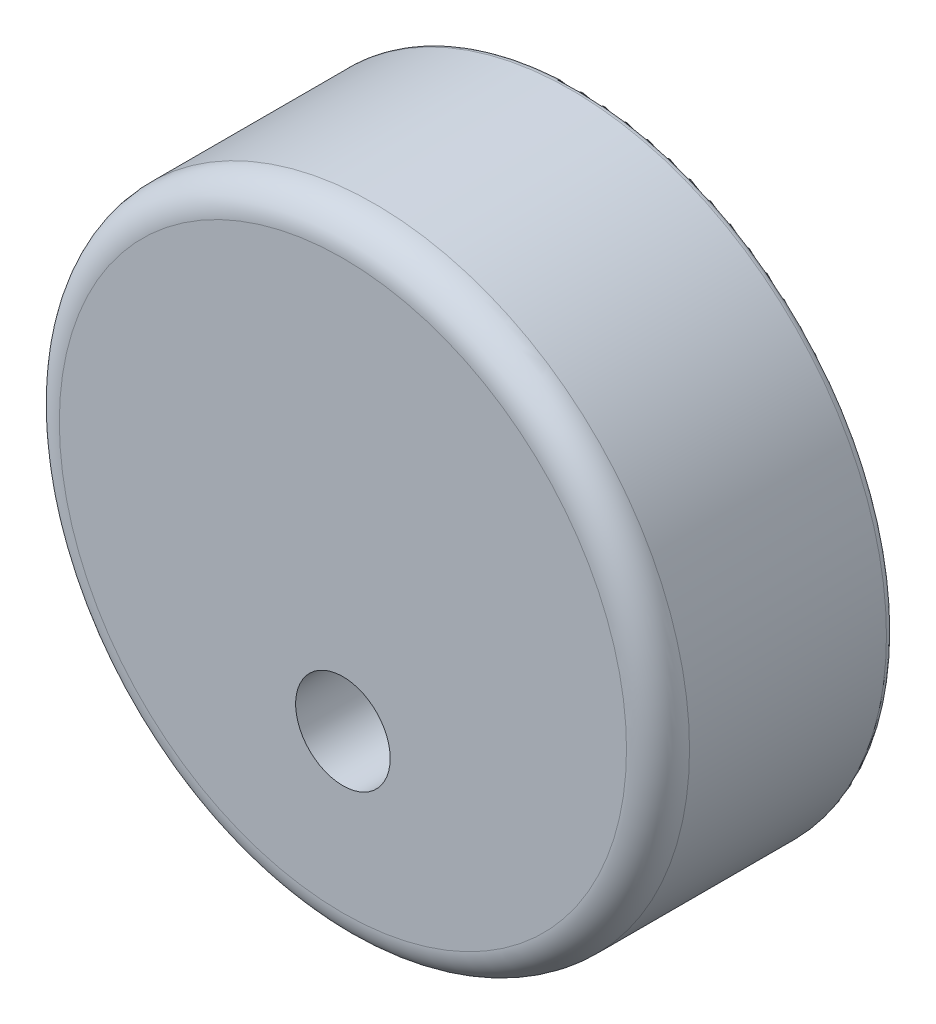
ISO-10303-21;
HEADER;
FILE_DESCRIPTION(('STEP AP214'),'2;1');
FILE_NAME('part.step','',(''),(''),'','','');
FILE_SCHEMA(('AUTOMOTIVE_DESIGN { 1 0 10303 214 1 1 1 1 }'));
ENDSEC;
DATA;
#1=APPLICATION_CONTEXT('core data for automotive mechanical design processes');
#2=APPLICATION_PROTOCOL_DEFINITION('international standard','automotive_design',2000,#1);
#3=PRODUCT_CONTEXT('',#1,'mechanical');
#4=PRODUCT('Part','Part','',(#3));
#5=PRODUCT_RELATED_PRODUCT_CATEGORY('part','',(#4));
#6=PRODUCT_DEFINITION_FORMATION('','',#4);
#7=PRODUCT_DEFINITION_CONTEXT('part definition',#1,'design');
#8=PRODUCT_DEFINITION('design','',#6,#7);
#9=PRODUCT_DEFINITION_SHAPE('','',#8);
#10=(LENGTH_UNIT() NAMED_UNIT(*) SI_UNIT(.MILLI.,.METRE.));
#11=(NAMED_UNIT(*) PLANE_ANGLE_UNIT() SI_UNIT($,.RADIAN.));
#12=(NAMED_UNIT(*) SI_UNIT($,.STERADIAN.) SOLID_ANGLE_UNIT());
#13=UNCERTAINTY_MEASURE_WITH_UNIT(LENGTH_MEASURE(1.E-05),#10,'distance_accuracy_value','');
#14=(GEOMETRIC_REPRESENTATION_CONTEXT(3) GLOBAL_UNCERTAINTY_ASSIGNED_CONTEXT((#13)) GLOBAL_UNIT_ASSIGNED_CONTEXT((#10,
#11,#12)) REPRESENTATION_CONTEXT('',''));
#15=CARTESIAN_POINT('',(0.,0.,0.));
#16=DIRECTION('',(0.,0.,1.));
#17=DIRECTION('',(1.,0.,0.));
#18=AXIS2_PLACEMENT_3D('',#15,#16,#17);
#19=CARTESIAN_POINT('',(0.,0.,15.));
#20=DIRECTION('',(0.,0.,-1.));
#21=DIRECTION('',(-1.,0.,0.));
#22=AXIS2_PLACEMENT_3D('',#19,#20,#21);
#23=CYLINDRICAL_SURFACE('',#22,20.);
#24=CARTESIAN_POINT('',(0.,0.,0.5));
#25=DIRECTION('',(0.,0.,1.));
#26=DIRECTION('',(1.,0.,0.));
#27=AXIS2_PLACEMENT_3D('',#24,#25,#26);
#28=CIRCLE('',#27,20.);
#29=CARTESIAN_POINT('',(20.,0.,0.5));
#30=VERTEX_POINT('',#29);
#31=EDGE_CURVE('E39',#30,#30,#28,.T.);
#32=ORIENTED_EDGE('',*,*,#31,.T.);
#33=EDGE_LOOP('',(#32));
#34=FACE_BOUND('',#33,.T.);
#35=CARTESIAN_POINT('',(0.,0.,13.));
#36=DIRECTION('',(0.,0.,1.));
#37=DIRECTION('',(1.,0.,0.));
#38=AXIS2_PLACEMENT_3D('',#35,#36,#37);
#39=CIRCLE('',#38,20.);
#40=CARTESIAN_POINT('',(20.,0.,13.));
#41=VERTEX_POINT('',#40);
#42=EDGE_CURVE('E43',#41,#41,#39,.F.);
#43=ORIENTED_EDGE('',*,*,#42,.T.);
#44=EDGE_LOOP('',(#43));
#45=FACE_BOUND('',#44,.T.);
#46=ADVANCED_FACE('F32',(#34,#45),#23,.T.);
#47=CARTESIAN_POINT('',(0.,0.,15.));
#48=DIRECTION('',(0.,0.,1.));
#49=DIRECTION('',(1.,0.,0.));
#50=AXIS2_PLACEMENT_3D('',#47,#48,#49);
#51=PLANE('',#50);
#52=CARTESIAN_POINT('',(0.,0.,15.));
#53=DIRECTION('',(0.,0.,1.));
#54=DIRECTION('',(1.,0.,0.));
#55=AXIS2_PLACEMENT_3D('',#52,#53,#54);
#56=CIRCLE('',#55,18.);
#57=CARTESIAN_POINT('',(18.,0.,15.));
#58=VERTEX_POINT('',#57);
#59=EDGE_CURVE('E47',#58,#58,#56,.T.);
#60=ORIENTED_EDGE('',*,*,#59,.T.);
#61=EDGE_LOOP('',(#60));
#62=FACE_BOUND('',#61,.T.);
#63=CARTESIAN_POINT('',(0.,-8.,15.));
#64=DIRECTION('',(0.,0.,1.));
#65=DIRECTION('',(1.,0.,0.));
#66=AXIS2_PLACEMENT_3D('',#63,#64,#65);
#67=CIRCLE('',#66,3.);
#68=CARTESIAN_POINT('',(3.,-8.,15.));
#69=VERTEX_POINT('',#68);
#70=EDGE_CURVE('E53',#69,#69,#67,.T.);
#71=ORIENTED_EDGE('',*,*,#70,.F.);
#72=EDGE_LOOP('',(#71));
#73=FACE_BOUND('',#72,.T.);
#74=ADVANCED_FACE('F68',(#62,#73),#51,.T.);
#75=CARTESIAN_POINT('',(0.,0.,0.));
#76=DIRECTION('',(0.,0.,1.));
#77=DIRECTION('',(1.,0.,0.));
#78=AXIS2_PLACEMENT_3D('',#75,#76,#77);
#79=PLANE('',#78);
#80=CARTESIAN_POINT('',(0.,0.,0.));
#81=DIRECTION('',(0.,0.,1.));
#82=DIRECTION('',(1.,0.,0.));
#83=AXIS2_PLACEMENT_3D('',#80,#81,#82);
#84=CIRCLE('',#83,19.5);
#85=CARTESIAN_POINT('',(19.5,0.,0.));
#86=VERTEX_POINT('',#85);
#87=EDGE_CURVE('E10',#86,#86,#84,.F.);
#88=ORIENTED_EDGE('',*,*,#87,.T.);
#89=EDGE_LOOP('',(#88));
#90=FACE_BOUND('',#89,.T.);
#91=CARTESIAN_POINT('',(0.,-8.,0.));
#92=DIRECTION('',(0.,0.,1.));
#93=DIRECTION('',(1.,0.,0.));
#94=AXIS2_PLACEMENT_3D('',#91,#92,#93);
#95=CIRCLE('',#94,3.);
#96=CARTESIAN_POINT('',(3.,-8.,0.));
#97=VERTEX_POINT('',#96);
#98=EDGE_CURVE('E52',#97,#97,#95,.T.);
#99=ORIENTED_EDGE('',*,*,#98,.T.);
#100=EDGE_LOOP('',(#99));
#101=FACE_BOUND('',#100,.T.);
#102=ADVANCED_FACE('F59',(#90,#101),#79,.F.);
#103=CARTESIAN_POINT('',(0.,-8.,0.));
#104=DIRECTION('',(0.,0.,1.));
#105=DIRECTION('',(1.,0.,0.));
#106=AXIS2_PLACEMENT_3D('',#103,#104,#105);
#107=CYLINDRICAL_SURFACE('',#106,3.);
#108=ORIENTED_EDGE('',*,*,#98,.F.);
#109=EDGE_LOOP('',(#108));
#110=FACE_BOUND('',#109,.T.);
#111=ORIENTED_EDGE('',*,*,#70,.T.);
#112=EDGE_LOOP('',(#111));
#113=FACE_BOUND('',#112,.T.);
#114=ADVANCED_FACE('F61',(#110,#113),#107,.F.);
#115=CARTESIAN_POINT('',(0.,0.,13.));
#116=DIRECTION('',(0.,0.,1.));
#117=DIRECTION('',(1.,0.,0.));
#118=AXIS2_PLACEMENT_3D('',#115,#116,#117);
#119=TOROIDAL_SURFACE('',#118,18.,2.);
#120=ORIENTED_EDGE('',*,*,#42,.F.);
#121=EDGE_LOOP('',(#120));
#122=FACE_BOUND('',#121,.T.);
#123=ORIENTED_EDGE('',*,*,#59,.F.);
#124=EDGE_LOOP('',(#123));
#125=FACE_BOUND('',#124,.T.);
#126=ADVANCED_FACE('F64',(#122,#125),#119,.T.);
#127=CARTESIAN_POINT('',(0.,0.,0.5));
#128=DIRECTION('',(0.,0.,1.));
#129=DIRECTION('',(1.,0.,0.));
#130=AXIS2_PLACEMENT_3D('',#127,#128,#129);
#131=TOROIDAL_SURFACE('',#130,19.5,0.5);
#132=ORIENTED_EDGE('',*,*,#87,.F.);
#133=EDGE_LOOP('',(#132));
#134=FACE_BOUND('',#133,.T.);
#135=ORIENTED_EDGE('',*,*,#31,.F.);
#136=EDGE_LOOP('',(#135));
#137=FACE_BOUND('',#136,.T.);
#138=ADVANCED_FACE('F34',(#134,#137),#131,.T.);
#139=CLOSED_SHELL('',(#46,#74,#102,#114,#126,#138));
#140=MANIFOLD_SOLID_BREP('B2',#139);
#141=ADVANCED_BREP_SHAPE_REPRESENTATION('',(#18,#140),#14);
#142=SHAPE_DEFINITION_REPRESENTATION(#9,#141);
ENDSEC;
END-ISO-10303-21;
